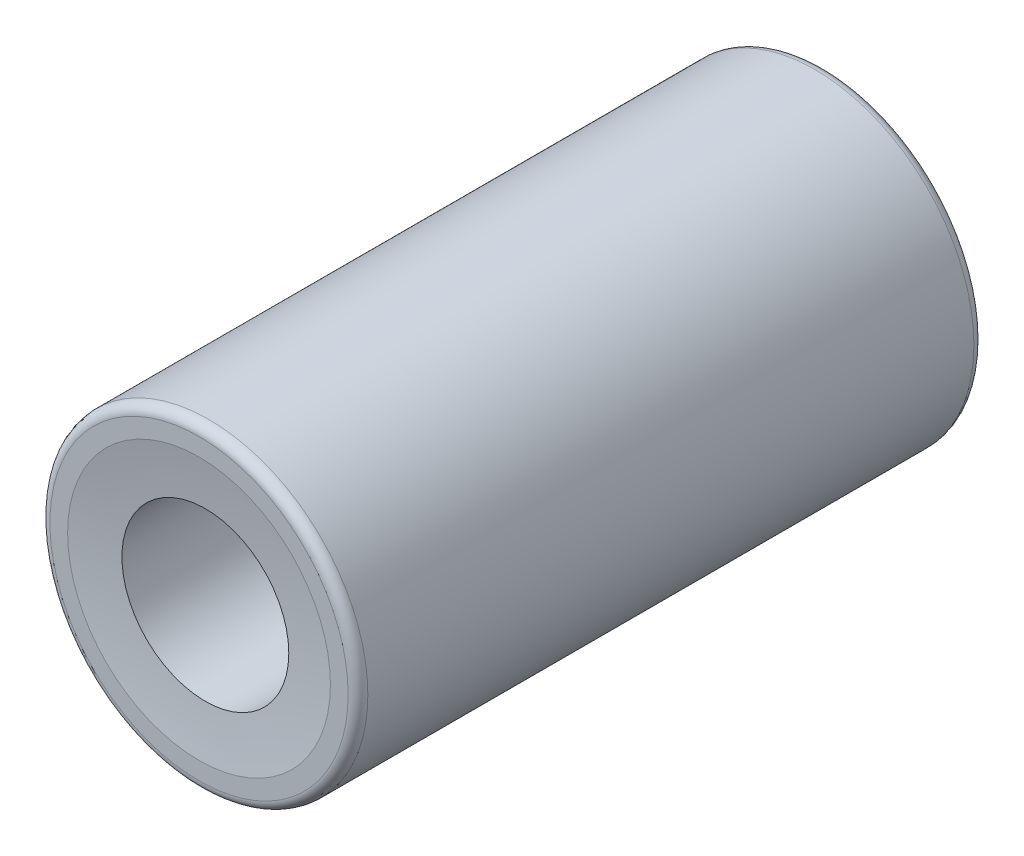
ISO-10303-21;
HEADER;
FILE_DESCRIPTION(('STEP AP214'),'2;1');
FILE_NAME('part.step','',(''),(''),'','','');
FILE_SCHEMA(('AUTOMOTIVE_DESIGN { 1 0 10303 214 1 1 1 1 }'));
ENDSEC;
DATA;
#1=APPLICATION_CONTEXT('core data for automotive mechanical design processes');
#2=APPLICATION_PROTOCOL_DEFINITION('international standard','automotive_design',2000,#1);
#3=PRODUCT_CONTEXT('',#1,'mechanical');
#4=PRODUCT('Part','Part','',(#3));
#5=PRODUCT_RELATED_PRODUCT_CATEGORY('part','',(#4));
#6=PRODUCT_DEFINITION_FORMATION('','',#4);
#7=PRODUCT_DEFINITION_CONTEXT('part definition',#1,'design');
#8=PRODUCT_DEFINITION('design','',#6,#7);
#9=PRODUCT_DEFINITION_SHAPE('','',#8);
#10=(LENGTH_UNIT() NAMED_UNIT(*) SI_UNIT(.MILLI.,.METRE.));
#11=(NAMED_UNIT(*) PLANE_ANGLE_UNIT() SI_UNIT($,.RADIAN.));
#12=(NAMED_UNIT(*) SI_UNIT($,.STERADIAN.) SOLID_ANGLE_UNIT());
#13=UNCERTAINTY_MEASURE_WITH_UNIT(LENGTH_MEASURE(1.E-05),#10,'distance_accuracy_value','');
#14=(GEOMETRIC_REPRESENTATION_CONTEXT(3) GLOBAL_UNCERTAINTY_ASSIGNED_CONTEXT((#13)) GLOBAL_UNIT_ASSIGNED_CONTEXT((#10,
#11,#12)) REPRESENTATION_CONTEXT('',''));
#15=CARTESIAN_POINT('',(0.,0.,0.));
#16=DIRECTION('',(0.,0.,1.));
#17=DIRECTION('',(1.,0.,0.));
#18=AXIS2_PLACEMENT_3D('',#15,#16,#17);
#19=CARTESIAN_POINT('',(0.,0.,-34.20292535851));
#20=DIRECTION('',(0.,1.,0.));
#21=DIRECTION('',(-0.162886747165166,0.,0.986644772751547));
#22=AXIS2_PLACEMENT_3D('',#19,#20,#21);
#23=SPHERICAL_SURFACE('',#22,25.);
#24=CARTESIAN_POINT('',(0.,0.,-34.20292535851));
#25=DIRECTION('',(0.,0.,-1.));
#26=DIRECTION('',(-1.,0.,0.));
#27=AXIS2_PLACEMENT_3D('',#24,#25,#26);
#28=SPHERICAL_SURFACE('',#27,25.);
#29=CARTESIAN_POINT('',(0.,0.,-9.33229207344868));
#30=DIRECTION('',(0.,0.,-1.));
#31=DIRECTION('',(-1.,0.,0.));
#32=AXIS2_PLACEMENT_3D('',#29,#30,#31);
#33=CIRCLE('',#32,2.54);
#34=CARTESIAN_POINT('',(-2.54,0.,-9.33229207344868));
#35=VERTEX_POINT('',#34);
#36=EDGE_CURVE('E68',#35,#35,#33,.F.);
#37=ORIENTED_EDGE('',*,*,#36,.T.);
#38=EDGE_LOOP('',(#37));
#39=FACE_BOUND('',#38,.T.);
#40=CARTESIAN_POINT('',(0.,0.,-9.525));
#41=DIRECTION('',(0.,0.,1.));
#42=DIRECTION('',(1.,0.,0.));
#43=AXIS2_PLACEMENT_3D('',#40,#41,#42);
#44=CIRCLE('',#43,3.99999999997613);
#45=CARTESIAN_POINT('',(3.99999999997615,0.,-9.525));
#46=VERTEX_POINT('',#45);
#47=EDGE_CURVE('E64',#46,#46,#44,.F.);
#48=ORIENTED_EDGE('',*,*,#47,.T.);
#49=EDGE_LOOP('',(#48));
#50=FACE_BOUND('',#49,.T.);
#51=ADVANCED_FACE('F43',(#39,#50),#28,.F.);
#52=CARTESIAN_POINT('',(1.39645239816133E-13,0.,34.2029253585101));
#53=DIRECTION('',(0.,1.,0.));
#54=DIRECTION('',(0.162886747165159,0.,-0.986644772751548));
#55=AXIS2_PLACEMENT_3D('',#52,#53,#54);
#56=SPHERICAL_SURFACE('',#55,25.);
#57=CARTESIAN_POINT('',(1.39645239816133E-13,0.,34.2029253585101));
#58=DIRECTION('',(0.,0.,1.));
#59=DIRECTION('',(1.,0.,0.));
#60=AXIS2_PLACEMENT_3D('',#57,#58,#59);
#61=SPHERICAL_SURFACE('',#60,25.);
#62=CARTESIAN_POINT('',(0.,0.,9.33229207344869));
#63=DIRECTION('',(0.,0.,1.));
#64=DIRECTION('',(1.,0.,0.));
#65=AXIS2_PLACEMENT_3D('',#62,#63,#64);
#66=CIRCLE('',#65,2.54);
#67=CARTESIAN_POINT('',(2.54,0.,9.33229207344869));
#68=VERTEX_POINT('',#67);
#69=EDGE_CURVE('E47',#68,#68,#66,.F.);
#70=ORIENTED_EDGE('',*,*,#69,.T.);
#71=EDGE_LOOP('',(#70));
#72=FACE_BOUND('',#71,.T.);
#73=CARTESIAN_POINT('',(1.39645239816133E-13,0.,9.525));
#74=DIRECTION('',(0.,0.,1.));
#75=DIRECTION('',(1.,0.,0.));
#76=AXIS2_PLACEMENT_3D('',#73,#74,#75);
#77=CIRCLE('',#76,3.99999999997601);
#78=CARTESIAN_POINT('',(3.99999999997615,0.,9.525));
#79=VERTEX_POINT('',#78);
#80=EDGE_CURVE('E63',#79,#79,#77,.F.);
#81=ORIENTED_EDGE('',*,*,#80,.F.);
#82=EDGE_LOOP('',(#81));
#83=FACE_BOUND('',#82,.T.);
#84=ADVANCED_FACE('F78',(#72,#83),#61,.F.);
#85=CARTESIAN_POINT('',(0.,0.,-9.525));
#86=DIRECTION('',(0.,0.,1.));
#87=DIRECTION('',(1.,0.,0.));
#88=AXIS2_PLACEMENT_3D('',#85,#86,#87);
#89=PLANE('',#88);
#90=CARTESIAN_POINT('',(0.,0.,-9.525));
#91=DIRECTION('',(0.,0.,1.));
#92=DIRECTION('',(1.,0.,0.));
#93=AXIS2_PLACEMENT_3D('',#90,#91,#92);
#94=CIRCLE('',#93,4.53888563614343);
#95=CARTESIAN_POINT('',(4.53888563614343,0.,-9.525));
#96=VERTEX_POINT('',#95);
#97=EDGE_CURVE('E12',#96,#96,#94,.F.);
#98=ORIENTED_EDGE('',*,*,#97,.T.);
#99=EDGE_LOOP('',(#98));
#100=FACE_BOUND('',#99,.T.);
#101=ORIENTED_EDGE('',*,*,#47,.F.);
#102=EDGE_LOOP('',(#101));
#103=FACE_BOUND('',#102,.T.);
#104=ADVANCED_FACE('F96',(#100,#103),#89,.F.);
#105=CARTESIAN_POINT('',(0.,0.,9.525));
#106=DIRECTION('',(0.,0.,1.));
#107=DIRECTION('',(1.,0.,0.));
#108=AXIS2_PLACEMENT_3D('',#105,#106,#107);
#109=PLANE('',#108);
#110=CARTESIAN_POINT('',(0.,0.,9.525));
#111=DIRECTION('',(0.,0.,1.));
#112=DIRECTION('',(1.,0.,0.));
#113=AXIS2_PLACEMENT_3D('',#110,#111,#112);
#114=CIRCLE('',#113,4.53888563614343);
#115=CARTESIAN_POINT('',(4.53888563614343,0.,9.525));
#116=VERTEX_POINT('',#115);
#117=EDGE_CURVE('E60',#116,#116,#114,.T.);
#118=ORIENTED_EDGE('',*,*,#117,.T.);
#119=EDGE_LOOP('',(#118));
#120=FACE_BOUND('',#119,.T.);
#121=ORIENTED_EDGE('',*,*,#80,.T.);
#122=EDGE_LOOP('',(#121));
#123=FACE_BOUND('',#122,.T.);
#124=ADVANCED_FACE('F277',(#120,#123),#109,.T.);
#125=CARTESIAN_POINT('',(0.,0.,-9.86223470405999));
#126=DIRECTION('',(0.,0.,1.));
#127=DIRECTION('',(1.,0.,0.));
#128=AXIS2_PLACEMENT_3D('',#125,#126,#127);
#129=CYLINDRICAL_SURFACE('',#128,4.83888563614343);
#130=CARTESIAN_POINT('',(0.,0.,9.225));
#131=DIRECTION('',(0.,0.,1.));
#132=DIRECTION('',(1.,0.,0.));
#133=AXIS2_PLACEMENT_3D('',#130,#131,#132);
#134=CIRCLE('',#133,4.83888563614343);
#135=CARTESIAN_POINT('',(4.83888563614343,0.,9.225));
#136=VERTEX_POINT('',#135);
#137=EDGE_CURVE('E51',#136,#136,#134,.F.);
#138=ORIENTED_EDGE('',*,*,#137,.T.);
#139=EDGE_LOOP('',(#138));
#140=FACE_BOUND('',#139,.T.);
#141=CARTESIAN_POINT('',(0.,0.,-9.225));
#142=DIRECTION('',(0.,0.,1.));
#143=DIRECTION('',(1.,0.,0.));
#144=AXIS2_PLACEMENT_3D('',#141,#142,#143);
#145=CIRCLE('',#144,4.83888563614343);
#146=CARTESIAN_POINT('',(4.83888563614343,0.,-9.225));
#147=VERTEX_POINT('',#146);
#148=EDGE_CURVE('E55',#147,#147,#145,.T.);
#149=ORIENTED_EDGE('',*,*,#148,.T.);
#150=EDGE_LOOP('',(#149));
#151=FACE_BOUND('',#150,.T.);
#152=ADVANCED_FACE('F98',(#140,#151),#129,.T.);
#153=CARTESIAN_POINT('',(0.,0.,9.225));
#154=DIRECTION('',(0.,0.,1.));
#155=DIRECTION('',(1.,0.,0.));
#156=AXIS2_PLACEMENT_3D('',#153,#154,#155);
#157=TOROIDAL_SURFACE('',#156,4.53888563614343,0.300000000000002);
#158=ORIENTED_EDGE('',*,*,#137,.F.);
#159=EDGE_LOOP('',(#158));
#160=FACE_BOUND('',#159,.T.);
#161=ORIENTED_EDGE('',*,*,#117,.F.);
#162=EDGE_LOOP('',(#161));
#163=FACE_BOUND('',#162,.T.);
#164=ADVANCED_FACE('F88',(#160,#163),#157,.T.);
#165=CARTESIAN_POINT('',(0.,0.,-9.225));
#166=DIRECTION('',(0.,0.,1.));
#167=DIRECTION('',(1.,0.,0.));
#168=AXIS2_PLACEMENT_3D('',#165,#166,#167);
#169=TOROIDAL_SURFACE('',#168,4.53888563614343,0.300000000000002);
#170=ORIENTED_EDGE('',*,*,#97,.F.);
#171=EDGE_LOOP('',(#170));
#172=FACE_BOUND('',#171,.T.);
#173=ORIENTED_EDGE('',*,*,#148,.F.);
#174=EDGE_LOOP('',(#173));
#175=FACE_BOUND('',#174,.T.);
#176=ADVANCED_FACE('F45',(#172,#175),#169,.T.);
#177=CARTESIAN_POINT('',(0.,0.,-9.525));
#178=DIRECTION('',(0.,0.,1.));
#179=DIRECTION('',(1.,0.,0.));
#180=AXIS2_PLACEMENT_3D('',#177,#178,#179);
#181=CYLINDRICAL_SURFACE('',#180,2.54);
#182=ORIENTED_EDGE('',*,*,#69,.F.);
#183=EDGE_LOOP('',(#182));
#184=FACE_BOUND('',#183,.T.);
#185=ORIENTED_EDGE('',*,*,#36,.F.);
#186=EDGE_LOOP('',(#185));
#187=FACE_BOUND('',#186,.T.);
#188=ADVANCED_FACE('F81',(#184,#187),#181,.F.);
#189=CLOSED_SHELL('',(#51,#84,#104,#124,#152,#164,#176,#188));
#190=MANIFOLD_SOLID_BREP('B2',#189);
#191=ADVANCED_BREP_SHAPE_REPRESENTATION('',(#18,#190),#14);
#192=SHAPE_DEFINITION_REPRESENTATION(#9,#191);
ENDSEC;
END-ISO-10303-21;
